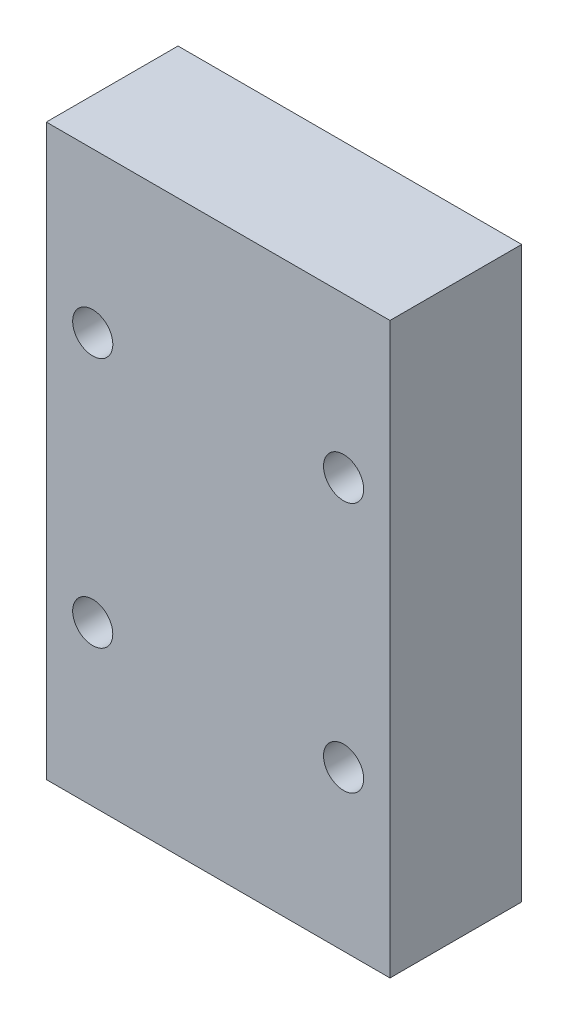
ISO-10303-21;
HEADER;
FILE_DESCRIPTION(('STEP AP214'),'2;1');
FILE_NAME('part.step','',(''),(''),'','','');
FILE_SCHEMA(('AUTOMOTIVE_DESIGN { 1 0 10303 214 1 1 1 1 }'));
ENDSEC;
DATA;
#1=APPLICATION_CONTEXT('core data for automotive mechanical design processes');
#2=APPLICATION_PROTOCOL_DEFINITION('international standard','automotive_design',2000,#1);
#3=PRODUCT_CONTEXT('',#1,'mechanical');
#4=PRODUCT('Part','Part','',(#3));
#5=PRODUCT_RELATED_PRODUCT_CATEGORY('part','',(#4));
#6=PRODUCT_DEFINITION_FORMATION('','',#4);
#7=PRODUCT_DEFINITION_CONTEXT('part definition',#1,'design');
#8=PRODUCT_DEFINITION('design','',#6,#7);
#9=PRODUCT_DEFINITION_SHAPE('','',#8);
#10=(LENGTH_UNIT() NAMED_UNIT(*) SI_UNIT(.MILLI.,.METRE.));
#11=(NAMED_UNIT(*) PLANE_ANGLE_UNIT() SI_UNIT($,.RADIAN.));
#12=(NAMED_UNIT(*) SI_UNIT($,.STERADIAN.) SOLID_ANGLE_UNIT());
#13=UNCERTAINTY_MEASURE_WITH_UNIT(LENGTH_MEASURE(1.E-05),#10,'distance_accuracy_value','');
#14=(GEOMETRIC_REPRESENTATION_CONTEXT(3) GLOBAL_UNCERTAINTY_ASSIGNED_CONTEXT((#13)) GLOBAL_UNIT_ASSIGNED_CONTEXT((#10,
#11,#12)) REPRESENTATION_CONTEXT('',''));
#15=CARTESIAN_POINT('',(0.,0.,0.));
#16=DIRECTION('',(0.,0.,1.));
#17=DIRECTION('',(1.,0.,0.));
#18=AXIS2_PLACEMENT_3D('',#15,#16,#17);
#19=CARTESIAN_POINT('',(426.761848113425,-83.5058640899704,-5.5));
#20=DIRECTION('',(-1.,0.,0.));
#21=DIRECTION('',(0.,-1.,0.));
#22=AXIS2_PLACEMENT_3D('',#19,#20,#21);
#23=PLANE('',#22);
#24=DIRECTION('',(0.,0.,1.));
#25=VECTOR('',#24,1.);
#26=CARTESIAN_POINT('',(426.761848113425,-83.5058640899704,-5.5));
#27=LINE('',#26,#25);
#28=CARTESIAN_POINT('',(426.761848113425,-83.5058640899704,-5.5));
#29=VERTEX_POINT('',#28);
#30=CARTESIAN_POINT('',(426.761848113425,-83.5058640899704,5.));
#31=VERTEX_POINT('',#30);
#32=EDGE_CURVE('E40',#29,#31,#27,.T.);
#33=ORIENTED_EDGE('',*,*,#32,.T.);
#34=DIRECTION('',(0.,-1.,0.));
#35=VECTOR('',#34,1.);
#36=CARTESIAN_POINT('',(426.761848113425,-83.5058640899704,5.));
#37=LINE('',#36,#35);
#38=CARTESIAN_POINT('',(426.761848113425,-38.1058640899704,5.));
#39=VERTEX_POINT('',#38);
#40=EDGE_CURVE('E77',#39,#31,#37,.T.);
#41=ORIENTED_EDGE('',*,*,#40,.F.);
#42=DIRECTION('',(0.,0.,1.));
#43=VECTOR('',#42,1.);
#44=CARTESIAN_POINT('',(426.761848113425,-38.1058640899704,-5.5));
#45=LINE('',#44,#43);
#46=CARTESIAN_POINT('',(426.761848113425,-38.1058640899704,-5.5));
#47=VERTEX_POINT('',#46);
#48=EDGE_CURVE('E11',#47,#39,#45,.T.);
#49=ORIENTED_EDGE('',*,*,#48,.F.);
#50=DIRECTION('',(0.,-1.,0.));
#51=VECTOR('',#50,1.);
#52=CARTESIAN_POINT('',(426.761848113425,-83.5058640899704,-5.5));
#53=LINE('',#52,#51);
#54=EDGE_CURVE('E78',#47,#29,#53,.T.);
#55=ORIENTED_EDGE('',*,*,#54,.T.);
#56=EDGE_LOOP('',(#33,#41,#49,#55));
#57=FACE_BOUND('',#56,.T.);
#58=ADVANCED_FACE('F37',(#57),#23,.T.);
#59=CARTESIAN_POINT('',(454.161848113425,-38.1058640899704,-5.5));
#60=DIRECTION('',(0.,1.,0.));
#61=DIRECTION('',(0.,0.,1.));
#62=AXIS2_PLACEMENT_3D('',#59,#60,#61);
#63=PLANE('',#62);
#64=ORIENTED_EDGE('',*,*,#48,.T.);
#65=DIRECTION('',(-1.,0.,0.));
#66=VECTOR('',#65,1.);
#67=CARTESIAN_POINT('',(454.161848113425,-38.1058640899704,5.));
#68=LINE('',#67,#66);
#69=CARTESIAN_POINT('',(454.161848113425,-38.1058640899704,5.));
#70=VERTEX_POINT('',#69);
#71=EDGE_CURVE('E95',#70,#39,#68,.T.);
#72=ORIENTED_EDGE('',*,*,#71,.F.);
#73=DIRECTION('',(0.,0.,1.));
#74=VECTOR('',#73,1.);
#75=CARTESIAN_POINT('',(454.161848113425,-38.1058640899704,-5.5));
#76=LINE('',#75,#74);
#77=CARTESIAN_POINT('',(454.161848113425,-38.1058640899704,-5.5));
#78=VERTEX_POINT('',#77);
#79=EDGE_CURVE('E45',#78,#70,#76,.T.);
#80=ORIENTED_EDGE('',*,*,#79,.F.);
#81=DIRECTION('',(-1.,0.,0.));
#82=VECTOR('',#81,1.);
#83=CARTESIAN_POINT('',(454.161848113425,-38.1058640899704,-5.5));
#84=LINE('',#83,#82);
#85=EDGE_CURVE('E83',#78,#47,#84,.T.);
#86=ORIENTED_EDGE('',*,*,#85,.T.);
#87=EDGE_LOOP('',(#64,#72,#80,#86));
#88=FACE_BOUND('',#87,.T.);
#89=ADVANCED_FACE('F127',(#88),#63,.T.);
#90=CARTESIAN_POINT('',(454.161848113424,-83.5058640899704,-5.5));
#91=DIRECTION('',(1.,0.,0.));
#92=DIRECTION('',(0.,1.,0.));
#93=AXIS2_PLACEMENT_3D('',#90,#91,#92);
#94=PLANE('',#93);
#95=ORIENTED_EDGE('',*,*,#79,.T.);
#96=DIRECTION('',(0.,1.,0.));
#97=VECTOR('',#96,1.);
#98=CARTESIAN_POINT('',(454.161848113424,-83.5058640899704,5.));
#99=LINE('',#98,#97);
#100=CARTESIAN_POINT('',(454.161848113424,-83.5058640899704,5.));
#101=VERTEX_POINT('',#100);
#102=EDGE_CURVE('E90',#101,#70,#99,.T.);
#103=ORIENTED_EDGE('',*,*,#102,.F.);
#104=DIRECTION('',(0.,0.,1.));
#105=VECTOR('',#104,1.);
#106=CARTESIAN_POINT('',(454.161848113424,-83.5058640899704,-5.5));
#107=LINE('',#106,#105);
#108=CARTESIAN_POINT('',(454.161848113424,-83.5058640899704,-5.5));
#109=VERTEX_POINT('',#108);
#110=EDGE_CURVE('E82',#109,#101,#107,.T.);
#111=ORIENTED_EDGE('',*,*,#110,.F.);
#112=DIRECTION('',(0.,1.,0.));
#113=VECTOR('',#112,1.);
#114=CARTESIAN_POINT('',(454.161848113424,-83.5058640899704,-5.5));
#115=LINE('',#114,#113);
#116=EDGE_CURVE('E120',#109,#78,#115,.T.);
#117=ORIENTED_EDGE('',*,*,#116,.T.);
#118=EDGE_LOOP('',(#95,#103,#111,#117));
#119=FACE_BOUND('',#118,.T.);
#120=ADVANCED_FACE('F124',(#119),#94,.T.);
#121=CARTESIAN_POINT('',(454.161848113424,-83.5058640899704,-5.5));
#122=DIRECTION('',(0.,-1.,0.));
#123=DIRECTION('',(0.,0.,-1.));
#124=AXIS2_PLACEMENT_3D('',#121,#122,#123);
#125=PLANE('',#124);
#126=ORIENTED_EDGE('',*,*,#110,.T.);
#127=DIRECTION('',(1.,0.,0.));
#128=VECTOR('',#127,1.);
#129=CARTESIAN_POINT('',(454.161848113424,-83.5058640899704,5.));
#130=LINE('',#129,#128);
#131=EDGE_CURVE('E85',#31,#101,#130,.T.);
#132=ORIENTED_EDGE('',*,*,#131,.F.);
#133=ORIENTED_EDGE('',*,*,#32,.F.);
#134=DIRECTION('',(1.,0.,0.));
#135=VECTOR('',#134,1.);
#136=CARTESIAN_POINT('',(454.161848113424,-83.5058640899704,-5.5));
#137=LINE('',#136,#135);
#138=EDGE_CURVE('E118',#29,#109,#137,.T.);
#139=ORIENTED_EDGE('',*,*,#138,.T.);
#140=EDGE_LOOP('',(#126,#132,#133,#139));
#141=FACE_BOUND('',#140,.T.);
#142=ADVANCED_FACE('F86',(#141),#125,.T.);
#143=CARTESIAN_POINT('',(0.,0.,-5.5));
#144=DIRECTION('',(0.,0.,1.));
#145=DIRECTION('',(1.,0.,0.));
#146=AXIS2_PLACEMENT_3D('',#143,#144,#145);
#147=PLANE('',#146);
#148=CARTESIAN_POINT('',(450.461848113425,-70.8058640899706,-5.5));
#149=DIRECTION('',(0.,0.,1.));
#150=DIRECTION('',(-1.,0.,0.));
#151=AXIS2_PLACEMENT_3D('',#148,#149,#150);
#152=CIRCLE('',#151,1.59999999979236);
#153=CARTESIAN_POINT('',(448.861848113632,-70.8058640899706,-5.5));
#154=VERTEX_POINT('',#153);
#155=EDGE_CURVE('E105',#154,#154,#152,.T.);
#156=ORIENTED_EDGE('',*,*,#155,.T.);
#157=EDGE_LOOP('',(#156));
#158=FACE_BOUND('',#157,.T.);
#159=CARTESIAN_POINT('',(450.461848113425,-50.8058640899705,-5.5));
#160=DIRECTION('',(0.,0.,1.));
#161=DIRECTION('',(1.,0.,0.));
#162=AXIS2_PLACEMENT_3D('',#159,#160,#161);
#163=CIRCLE('',#162,1.59999999833983);
#164=CARTESIAN_POINT('',(452.061848111764,-50.8058640899705,-5.5));
#165=VERTEX_POINT('',#164);
#166=EDGE_CURVE('E108',#165,#165,#163,.T.);
#167=ORIENTED_EDGE('',*,*,#166,.T.);
#168=EDGE_LOOP('',(#167));
#169=FACE_BOUND('',#168,.T.);
#170=CARTESIAN_POINT('',(430.461848113425,-50.8058640899705,-5.5));
#171=DIRECTION('',(0.,0.,1.));
#172=DIRECTION('',(-1.,0.,0.));
#173=AXIS2_PLACEMENT_3D('',#170,#171,#172);
#174=CIRCLE('',#173,1.59999999833983);
#175=CARTESIAN_POINT('',(428.861848115085,-50.8058640899705,-5.5));
#176=VERTEX_POINT('',#175);
#177=EDGE_CURVE('E111',#176,#176,#174,.T.);
#178=ORIENTED_EDGE('',*,*,#177,.T.);
#179=EDGE_LOOP('',(#178));
#180=FACE_BOUND('',#179,.T.);
#181=CARTESIAN_POINT('',(430.461848113425,-70.8058640899706,-5.5));
#182=DIRECTION('',(0.,0.,1.));
#183=DIRECTION('',(1.,0.,0.));
#184=AXIS2_PLACEMENT_3D('',#181,#182,#183);
#185=CIRCLE('',#184,1.59999999979236);
#186=CARTESIAN_POINT('',(432.061848113217,-70.8058640899706,-5.5));
#187=VERTEX_POINT('',#186);
#188=EDGE_CURVE('E114',#187,#187,#185,.T.);
#189=ORIENTED_EDGE('',*,*,#188,.T.);
#190=EDGE_LOOP('',(#189));
#191=FACE_BOUND('',#190,.T.);
#192=ORIENTED_EDGE('',*,*,#54,.F.);
#193=ORIENTED_EDGE('',*,*,#85,.F.);
#194=ORIENTED_EDGE('',*,*,#116,.F.);
#195=ORIENTED_EDGE('',*,*,#138,.F.);
#196=EDGE_LOOP('',(#192,#193,#194,#195));
#197=FACE_BOUND('',#196,.T.);
#198=ADVANCED_FACE('F129',(#158,#169,#180,#191,#197),#147,.F.);
#199=CARTESIAN_POINT('',(430.461848113425,-70.8058640899706,-5.5));
#200=DIRECTION('',(0.,0.,1.));
#201=DIRECTION('',(1.,0.,0.));
#202=AXIS2_PLACEMENT_3D('',#199,#200,#201);
#203=CYLINDRICAL_SURFACE('',#202,1.59999999979236);
#204=ORIENTED_EDGE('',*,*,#188,.F.);
#205=EDGE_LOOP('',(#204));
#206=FACE_BOUND('',#205,.T.);
#207=CARTESIAN_POINT('',(430.461848113425,-70.8058640899706,5.));
#208=DIRECTION('',(0.,0.,1.));
#209=DIRECTION('',(1.,0.,0.));
#210=AXIS2_PLACEMENT_3D('',#207,#208,#209);
#211=CIRCLE('',#210,1.59999999979236);
#212=CARTESIAN_POINT('',(432.061848113217,-70.8058640899706,5.));
#213=VERTEX_POINT('',#212);
#214=EDGE_CURVE('E96',#213,#213,#211,.T.);
#215=ORIENTED_EDGE('',*,*,#214,.T.);
#216=EDGE_LOOP('',(#215));
#217=FACE_BOUND('',#216,.T.);
#218=ADVANCED_FACE('F131',(#206,#217),#203,.F.);
#219=CARTESIAN_POINT('',(430.461848113425,-50.8058640899705,-5.5));
#220=DIRECTION('',(0.,0.,1.));
#221=DIRECTION('',(1.,0.,0.));
#222=AXIS2_PLACEMENT_3D('',#219,#220,#221);
#223=CYLINDRICAL_SURFACE('',#222,1.59999999833983);
#224=ORIENTED_EDGE('',*,*,#177,.F.);
#225=EDGE_LOOP('',(#224));
#226=FACE_BOUND('',#225,.T.);
#227=CARTESIAN_POINT('',(430.461848113425,-50.8058640899705,5.));
#228=DIRECTION('',(0.,0.,1.));
#229=DIRECTION('',(-1.,0.,0.));
#230=AXIS2_PLACEMENT_3D('',#227,#228,#229);
#231=CIRCLE('',#230,1.59999999833983);
#232=CARTESIAN_POINT('',(428.861848115085,-50.8058640899705,5.));
#233=VERTEX_POINT('',#232);
#234=EDGE_CURVE('E99',#233,#233,#231,.T.);
#235=ORIENTED_EDGE('',*,*,#234,.T.);
#236=EDGE_LOOP('',(#235));
#237=FACE_BOUND('',#236,.T.);
#238=ADVANCED_FACE('F138',(#226,#237),#223,.F.);
#239=CARTESIAN_POINT('',(450.461848113425,-50.8058640899705,-5.5));
#240=DIRECTION('',(0.,0.,1.));
#241=DIRECTION('',(1.,0.,0.));
#242=AXIS2_PLACEMENT_3D('',#239,#240,#241);
#243=CYLINDRICAL_SURFACE('',#242,1.59999999833983);
#244=ORIENTED_EDGE('',*,*,#166,.F.);
#245=EDGE_LOOP('',(#244));
#246=FACE_BOUND('',#245,.T.);
#247=CARTESIAN_POINT('',(450.461848113425,-50.8058640899705,5.));
#248=DIRECTION('',(0.,0.,1.));
#249=DIRECTION('',(1.,0.,0.));
#250=AXIS2_PLACEMENT_3D('',#247,#248,#249);
#251=CIRCLE('',#250,1.59999999833983);
#252=CARTESIAN_POINT('',(452.061848111764,-50.8058640899705,5.));
#253=VERTEX_POINT('',#252);
#254=EDGE_CURVE('E242',#253,#253,#251,.T.);
#255=ORIENTED_EDGE('',*,*,#254,.T.);
#256=EDGE_LOOP('',(#255));
#257=FACE_BOUND('',#256,.T.);
#258=ADVANCED_FACE('F179',(#246,#257),#243,.F.);
#259=CARTESIAN_POINT('',(450.461848113425,-70.8058640899706,-5.5));
#260=DIRECTION('',(0.,0.,1.));
#261=DIRECTION('',(1.,0.,0.));
#262=AXIS2_PLACEMENT_3D('',#259,#260,#261);
#263=CYLINDRICAL_SURFACE('',#262,1.59999999979236);
#264=ORIENTED_EDGE('',*,*,#155,.F.);
#265=EDGE_LOOP('',(#264));
#266=FACE_BOUND('',#265,.T.);
#267=CARTESIAN_POINT('',(450.461848113425,-70.8058640899706,5.));
#268=DIRECTION('',(0.,0.,1.));
#269=DIRECTION('',(-1.,0.,0.));
#270=AXIS2_PLACEMENT_3D('',#267,#268,#269);
#271=CIRCLE('',#270,1.59999999979236);
#272=CARTESIAN_POINT('',(448.861848113632,-70.8058640899706,5.));
#273=VERTEX_POINT('',#272);
#274=EDGE_CURVE('E246',#273,#273,#271,.T.);
#275=ORIENTED_EDGE('',*,*,#274,.T.);
#276=EDGE_LOOP('',(#275));
#277=FACE_BOUND('',#276,.T.);
#278=ADVANCED_FACE('F190',(#266,#277),#263,.F.);
#279=CARTESIAN_POINT('',(0.,0.,5.));
#280=DIRECTION('',(0.,0.,1.));
#281=DIRECTION('',(1.,0.,0.));
#282=AXIS2_PLACEMENT_3D('',#279,#280,#281);
#283=PLANE('',#282);
#284=ORIENTED_EDGE('',*,*,#254,.F.);
#285=EDGE_LOOP('',(#284));
#286=FACE_BOUND('',#285,.T.);
#287=ORIENTED_EDGE('',*,*,#214,.F.);
#288=EDGE_LOOP('',(#287));
#289=FACE_BOUND('',#288,.T.);
#290=ORIENTED_EDGE('',*,*,#40,.T.);
#291=ORIENTED_EDGE('',*,*,#131,.T.);
#292=ORIENTED_EDGE('',*,*,#102,.T.);
#293=ORIENTED_EDGE('',*,*,#71,.T.);
#294=EDGE_LOOP('',(#290,#291,#292,#293));
#295=FACE_BOUND('',#294,.T.);
#296=ORIENTED_EDGE('',*,*,#234,.F.);
#297=EDGE_LOOP('',(#296));
#298=FACE_BOUND('',#297,.T.);
#299=ORIENTED_EDGE('',*,*,#274,.F.);
#300=EDGE_LOOP('',(#299));
#301=FACE_BOUND('',#300,.T.);
#302=ADVANCED_FACE('F93',(#286,#289,#295,#298,#301),#283,.T.);
#303=CLOSED_SHELL('',(#58,#89,#120,#142,#198,#218,#238,#258,#278,#302));
#304=MANIFOLD_SOLID_BREP('B2',#303);
#305=ADVANCED_BREP_SHAPE_REPRESENTATION('',(#18,#304),#14);
#306=SHAPE_DEFINITION_REPRESENTATION(#9,#305);
ENDSEC;
END-ISO-10303-21;
